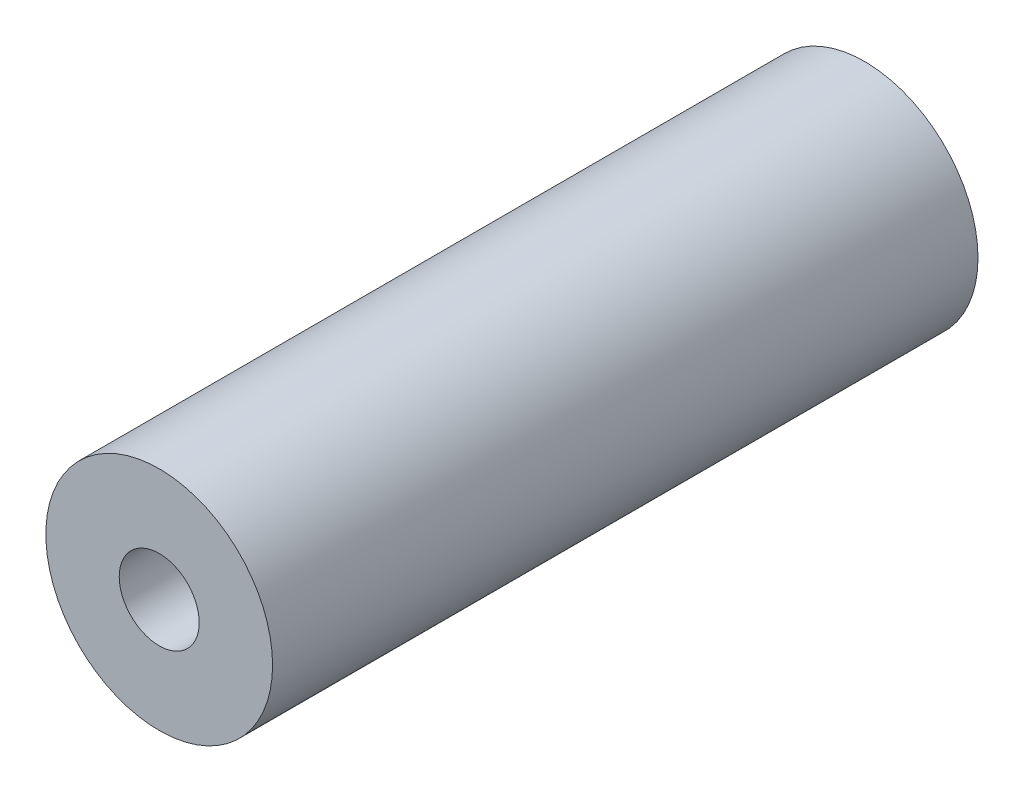
ISO-10303-21;
HEADER;
FILE_DESCRIPTION(('STEP AP214'),'2;1');
FILE_NAME('part.step','',(''),(''),'','','');
FILE_SCHEMA(('AUTOMOTIVE_DESIGN { 1 0 10303 214 1 1 1 1 }'));
ENDSEC;
DATA;
#1=APPLICATION_CONTEXT('core data for automotive mechanical design processes');
#2=APPLICATION_PROTOCOL_DEFINITION('international standard','automotive_design',2000,#1);
#3=PRODUCT_CONTEXT('',#1,'mechanical');
#4=PRODUCT('Part','Part','',(#3));
#5=PRODUCT_RELATED_PRODUCT_CATEGORY('part','',(#4));
#6=PRODUCT_DEFINITION_FORMATION('','',#4);
#7=PRODUCT_DEFINITION_CONTEXT('part definition',#1,'design');
#8=PRODUCT_DEFINITION('design','',#6,#7);
#9=PRODUCT_DEFINITION_SHAPE('','',#8);
#10=(LENGTH_UNIT() NAMED_UNIT(*) SI_UNIT(.MILLI.,.METRE.));
#11=(NAMED_UNIT(*) PLANE_ANGLE_UNIT() SI_UNIT($,.RADIAN.));
#12=(NAMED_UNIT(*) SI_UNIT($,.STERADIAN.) SOLID_ANGLE_UNIT());
#13=UNCERTAINTY_MEASURE_WITH_UNIT(LENGTH_MEASURE(1.E-05),#10,'distance_accuracy_value','');
#14=(GEOMETRIC_REPRESENTATION_CONTEXT(3) GLOBAL_UNCERTAINTY_ASSIGNED_CONTEXT((#13)) GLOBAL_UNIT_ASSIGNED_CONTEXT((#10,
#11,#12)) REPRESENTATION_CONTEXT('',''));
#15=CARTESIAN_POINT('',(0.,0.,0.));
#16=DIRECTION('',(0.,0.,1.));
#17=DIRECTION('',(1.,0.,0.));
#18=AXIS2_PLACEMENT_3D('',#15,#16,#17);
#19=CARTESIAN_POINT('',(0.,0.,56.));
#20=DIRECTION('',(0.,0.,-1.));
#21=DIRECTION('',(-1.,0.,0.));
#22=AXIS2_PLACEMENT_3D('',#19,#20,#21);
#23=CYLINDRICAL_SURFACE('',#22,9.);
#24=CARTESIAN_POINT('',(0.,0.,56.));
#25=DIRECTION('',(0.,0.,1.));
#26=DIRECTION('',(1.,0.,0.));
#27=AXIS2_PLACEMENT_3D('',#24,#25,#26);
#28=CIRCLE('',#27,9.);
#29=CARTESIAN_POINT('',(9.,0.,56.));
#30=VERTEX_POINT('',#29);
#31=EDGE_CURVE('E10',#30,#30,#28,.T.);
#32=ORIENTED_EDGE('',*,*,#31,.F.);
#33=EDGE_LOOP('',(#32));
#34=FACE_BOUND('',#33,.T.);
#35=CARTESIAN_POINT('',(0.,0.,0.));
#36=DIRECTION('',(0.,0.,1.));
#37=DIRECTION('',(1.,0.,0.));
#38=AXIS2_PLACEMENT_3D('',#35,#36,#37);
#39=CIRCLE('',#38,9.);
#40=CARTESIAN_POINT('',(9.,0.,0.));
#41=VERTEX_POINT('',#40);
#42=EDGE_CURVE('E33',#41,#41,#39,.T.);
#43=ORIENTED_EDGE('',*,*,#42,.T.);
#44=EDGE_LOOP('',(#43));
#45=FACE_BOUND('',#44,.T.);
#46=ADVANCED_FACE('F30',(#34,#45),#23,.T.);
#47=CARTESIAN_POINT('',(0.,0.,56.));
#48=DIRECTION('',(0.,0.,1.));
#49=DIRECTION('',(1.,0.,0.));
#50=AXIS2_PLACEMENT_3D('',#47,#48,#49);
#51=PLANE('',#50);
#52=CARTESIAN_POINT('',(0.,0.,56.));
#53=DIRECTION('',(0.,0.,-1.));
#54=DIRECTION('',(-1.,0.,0.));
#55=AXIS2_PLACEMENT_3D('',#52,#53,#54);
#56=CIRCLE('',#55,3.175);
#57=CARTESIAN_POINT('',(-3.175,0.,56.));
#58=VERTEX_POINT('',#57);
#59=EDGE_CURVE('E45',#58,#58,#56,.T.);
#60=ORIENTED_EDGE('',*,*,#59,.T.);
#61=EDGE_LOOP('',(#60));
#62=FACE_BOUND('',#61,.T.);
#63=ORIENTED_EDGE('',*,*,#31,.T.);
#64=EDGE_LOOP('',(#63));
#65=FACE_BOUND('',#64,.T.);
#66=ADVANCED_FACE('F54',(#62,#65),#51,.T.);
#67=CARTESIAN_POINT('',(0.,0.,0.));
#68=DIRECTION('',(0.,0.,1.));
#69=DIRECTION('',(1.,0.,0.));
#70=AXIS2_PLACEMENT_3D('',#67,#68,#69);
#71=PLANE('',#70);
#72=CARTESIAN_POINT('',(0.,0.,0.));
#73=DIRECTION('',(0.,0.,-1.));
#74=DIRECTION('',(-1.,0.,0.));
#75=AXIS2_PLACEMENT_3D('',#72,#73,#74);
#76=CIRCLE('',#75,5.615);
#77=CARTESIAN_POINT('',(-5.615,0.,0.));
#78=VERTEX_POINT('',#77);
#79=EDGE_CURVE('E42',#78,#78,#76,.T.);
#80=ORIENTED_EDGE('',*,*,#79,.F.);
#81=EDGE_LOOP('',(#80));
#82=FACE_BOUND('',#81,.T.);
#83=ORIENTED_EDGE('',*,*,#42,.F.);
#84=EDGE_LOOP('',(#83));
#85=FACE_BOUND('',#84,.T.);
#86=ADVANCED_FACE('F71',(#82,#85),#71,.F.);
#87=CARTESIAN_POINT('',(0.,0.,7.54));
#88=DIRECTION('',(0.,0.,-1.));
#89=DIRECTION('',(-1.,0.,0.));
#90=AXIS2_PLACEMENT_3D('',#87,#88,#89);
#91=CYLINDRICAL_SURFACE('',#90,5.615);
#92=CARTESIAN_POINT('',(0.,0.,7.54));
#93=DIRECTION('',(0.,0.,-1.));
#94=DIRECTION('',(-1.,0.,0.));
#95=AXIS2_PLACEMENT_3D('',#92,#93,#94);
#96=CIRCLE('',#95,5.615);
#97=CARTESIAN_POINT('',(-5.615,0.,7.54));
#98=VERTEX_POINT('',#97);
#99=EDGE_CURVE('E40',#98,#98,#96,.T.);
#100=ORIENTED_EDGE('',*,*,#99,.F.);
#101=EDGE_LOOP('',(#100));
#102=FACE_BOUND('',#101,.T.);
#103=ORIENTED_EDGE('',*,*,#79,.T.);
#104=EDGE_LOOP('',(#103));
#105=FACE_BOUND('',#104,.T.);
#106=ADVANCED_FACE('F65',(#102,#105),#91,.F.);
#107=CARTESIAN_POINT('',(0.,0.,7.54));
#108=DIRECTION('',(0.,0.,-1.));
#109=DIRECTION('',(-1.,0.,0.));
#110=AXIS2_PLACEMENT_3D('',#107,#108,#109);
#111=PLANE('',#110);
#112=CARTESIAN_POINT('',(0.,0.,7.54));
#113=DIRECTION('',(0.,0.,-1.));
#114=DIRECTION('',(-1.,0.,0.));
#115=AXIS2_PLACEMENT_3D('',#112,#113,#114);
#116=CIRCLE('',#115,3.175);
#117=CARTESIAN_POINT('',(-3.175,0.,7.54));
#118=VERTEX_POINT('',#117);
#119=EDGE_CURVE('E48',#118,#118,#116,.T.);
#120=ORIENTED_EDGE('',*,*,#119,.F.);
#121=EDGE_LOOP('',(#120));
#122=FACE_BOUND('',#121,.T.);
#123=ORIENTED_EDGE('',*,*,#99,.T.);
#124=EDGE_LOOP('',(#123));
#125=FACE_BOUND('',#124,.T.);
#126=ADVANCED_FACE('F59',(#122,#125),#111,.T.);
#127=CARTESIAN_POINT('',(0.,0.,56.));
#128=DIRECTION('',(0.,0.,-1.));
#129=DIRECTION('',(-1.,0.,0.));
#130=AXIS2_PLACEMENT_3D('',#127,#128,#129);
#131=CYLINDRICAL_SURFACE('',#130,3.175);
#132=ORIENTED_EDGE('',*,*,#59,.F.);
#133=EDGE_LOOP('',(#132));
#134=FACE_BOUND('',#133,.T.);
#135=ORIENTED_EDGE('',*,*,#119,.T.);
#136=EDGE_LOOP('',(#135));
#137=FACE_BOUND('',#136,.T.);
#138=ADVANCED_FACE('F56',(#134,#137),#131,.F.);
#139=CLOSED_SHELL('',(#46,#66,#86,#106,#126,#138));
#140=MANIFOLD_SOLID_BREP('B2',#139);
#141=ADVANCED_BREP_SHAPE_REPRESENTATION('',(#18,#140),#14);
#142=SHAPE_DEFINITION_REPRESENTATION(#9,#141);
ENDSEC;
END-ISO-10303-21;
